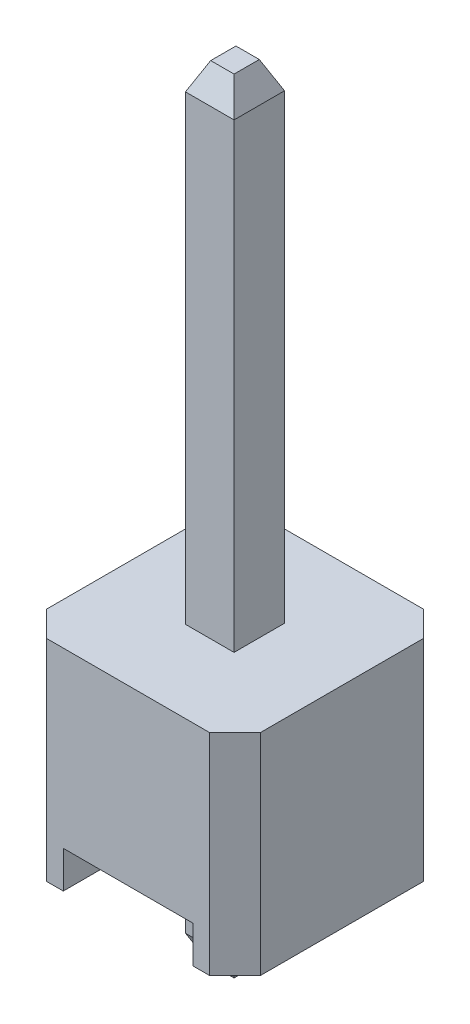
ISO-10303-21;
HEADER;
FILE_DESCRIPTION(('STEP AP214'),'2;1');
FILE_NAME('part.step','',(''),(''),'','','');
FILE_SCHEMA(('AUTOMOTIVE_DESIGN { 1 0 10303 214 1 1 1 1 }'));
ENDSEC;
DATA;
#1=APPLICATION_CONTEXT('core data for automotive mechanical design processes');
#2=APPLICATION_PROTOCOL_DEFINITION('international standard','automotive_design',2000,#1);
#3=PRODUCT_CONTEXT('',#1,'mechanical');
#4=PRODUCT('Part','Part','',(#3));
#5=PRODUCT_RELATED_PRODUCT_CATEGORY('part','',(#4));
#6=PRODUCT_DEFINITION_FORMATION('','',#4);
#7=PRODUCT_DEFINITION_CONTEXT('part definition',#1,'design');
#8=PRODUCT_DEFINITION('design','',#6,#7);
#9=PRODUCT_DEFINITION_SHAPE('','',#8);
#10=(LENGTH_UNIT() NAMED_UNIT(*) SI_UNIT(.MILLI.,.METRE.));
#11=(NAMED_UNIT(*) PLANE_ANGLE_UNIT() SI_UNIT($,.RADIAN.));
#12=(NAMED_UNIT(*) SI_UNIT($,.STERADIAN.) SOLID_ANGLE_UNIT());
#13=UNCERTAINTY_MEASURE_WITH_UNIT(LENGTH_MEASURE(1.E-05),#10,'distance_accuracy_value','');
#14=(GEOMETRIC_REPRESENTATION_CONTEXT(3) GLOBAL_UNCERTAINTY_ASSIGNED_CONTEXT((#13)) GLOBAL_UNIT_ASSIGNED_CONTEXT((#10,
#11,#12)) REPRESENTATION_CONTEXT('',''));
#15=CARTESIAN_POINT('',(0.,0.,0.));
#16=DIRECTION('',(0.,0.,1.));
#17=DIRECTION('',(1.,0.,0.));
#18=AXIS2_PLACEMENT_3D('',#15,#16,#17);
#19=CARTESIAN_POINT('',(-19.1812561045914,-5.69124998633488,-1.58837288882801));
#20=DIRECTION('',(0.,-1.,0.));
#21=DIRECTION('',(0.,0.,-1.));
#22=AXIS2_PLACEMENT_3D('',#19,#20,#21);
#23=PLANE('',#22);
#24=DIRECTION('',(0.,0.,1.));
#25=VECTOR('',#24,1.);
#26=CARTESIAN_POINT('',(-19.0312561045914,-5.69124998633488,-0.988372888828007));
#27=LINE('',#26,#25);
#28=CARTESIAN_POINT('',(-19.0312561045914,-5.69124998633488,-1.13837288882801));
#29=VERTEX_POINT('',#28);
#30=CARTESIAN_POINT('',(-19.0312561045914,-5.69124998633488,-1.43837288882801));
#31=VERTEX_POINT('',#30);
#32=EDGE_CURVE('E194',#29,#31,#27,.F.);
#33=ORIENTED_EDGE('',*,*,#32,.T.);
#34=DIRECTION('',(1.,0.,0.));
#35=VECTOR('',#34,1.);
#36=CARTESIAN_POINT('',(-19.1812561045914,-5.69124998633488,-1.43837288882801));
#37=LINE('',#36,#35);
#38=CARTESIAN_POINT('',(-18.7537499744834,-5.69124998633488,-1.43837288882801));
#39=VERTEX_POINT('',#38);
#40=EDGE_CURVE('E179',#31,#39,#37,.T.);
#41=ORIENTED_EDGE('',*,*,#40,.T.);
#42=DIRECTION('',(0.,0.,1.));
#43=VECTOR('',#42,1.);
#44=CARTESIAN_POINT('',(-18.7537499744834,-5.69124998633488,-1.58837288882801));
#45=LINE('',#44,#43);
#46=CARTESIAN_POINT('',(-18.7537499744834,-5.69124998633488,-1.13837288882801));
#47=VERTEX_POINT('',#46);
#48=EDGE_CURVE('E20',#39,#47,#45,.T.);
#49=ORIENTED_EDGE('',*,*,#48,.T.);
#50=DIRECTION('',(1.,0.,0.));
#51=VECTOR('',#50,1.);
#52=CARTESIAN_POINT('',(-18.6037499744834,-5.69124998633488,-1.13837288882801));
#53=LINE('',#52,#51);
#54=EDGE_CURVE('E174',#47,#29,#53,.F.);
#55=ORIENTED_EDGE('',*,*,#54,.T.);
#56=EDGE_LOOP('',(#33,#41,#49,#55));
#57=FACE_BOUND('',#56,.T.);
#58=ADVANCED_FACE('F17',(#57),#23,.T.);
#59=CARTESIAN_POINT('',(-18.6037499744834,-5.36957394825845,-1.58837288882801));
#60=DIRECTION('',(-0.90630778703665,0.4226182617407,0.));
#61=DIRECTION('',(-0.4226182617407,-0.90630778703665,0.));
#62=AXIS2_PLACEMENT_3D('',#59,#60,#61);
#63=PLANE('',#62);
#64=DIRECTION('',(0.,0.,-1.));
#65=VECTOR('',#64,1.);
#66=CARTESIAN_POINT('',(-18.6037499744834,-5.36957394825845,-1.58837288882801));
#67=LINE('',#66,#65);
#68=CARTESIAN_POINT('',(-18.6037499744834,-5.36957394825845,-0.988372888828007));
#69=VERTEX_POINT('',#68);
#70=CARTESIAN_POINT('',(-18.6037499744834,-5.36957394825845,-1.58837288882801));
#71=VERTEX_POINT('',#70);
#72=EDGE_CURVE('E186',#69,#71,#67,.T.);
#73=ORIENTED_EDGE('',*,*,#72,.F.);
#74=DIRECTION('',(-0.389281620635035,-0.834817129478983,-0.389281620635025));
#75=VECTOR('',#74,1.);
#76=CARTESIAN_POINT('',(-18.6037499744834,-5.36957394825845,-0.988372888828007));
#77=LINE('',#76,#75);
#78=EDGE_CURVE('E182',#69,#47,#77,.T.);
#79=ORIENTED_EDGE('',*,*,#78,.T.);
#80=ORIENTED_EDGE('',*,*,#48,.F.);
#81=DIRECTION('',(0.389281620635035,0.834817129478983,-0.389281620635025));
#82=VECTOR('',#81,1.);
#83=CARTESIAN_POINT('',(-18.7537499744834,-5.69124998633488,-1.43837288882801));
#84=LINE('',#83,#82);
#85=EDGE_CURVE('E202',#39,#71,#84,.T.);
#86=ORIENTED_EDGE('',*,*,#85,.T.);
#87=EDGE_LOOP('',(#73,#79,#80,#86));
#88=FACE_BOUND('',#87,.T.);
#89=ADVANCED_FACE('F184',(#88),#63,.F.);
#90=CARTESIAN_POINT('',(-18.6037499744834,-5.36957394825845,-0.988372888828007));
#91=DIRECTION('',(0.,0.422618261740701,-0.906307787036649));
#92=DIRECTION('',(0.,0.906307787036649,0.422618261740701));
#93=AXIS2_PLACEMENT_3D('',#90,#91,#92);
#94=PLANE('',#93);
#95=ORIENTED_EDGE('',*,*,#54,.F.);
#96=ORIENTED_EDGE('',*,*,#78,.F.);
#97=DIRECTION('',(1.,0.,0.));
#98=VECTOR('',#97,1.);
#99=CARTESIAN_POINT('',(-18.6037499744834,-5.36957394825845,-0.988372888828007));
#100=LINE('',#99,#98);
#101=CARTESIAN_POINT('',(-19.1812561045914,-5.36957394825845,-0.988372888828007));
#102=VERTEX_POINT('',#101);
#103=EDGE_CURVE('E205',#102,#69,#100,.T.);
#104=ORIENTED_EDGE('',*,*,#103,.F.);
#105=DIRECTION('',(0.389281620635027,-0.834817129478987,-0.389281620635025));
#106=VECTOR('',#105,1.);
#107=CARTESIAN_POINT('',(-19.1812561045914,-5.36957394825845,-0.988372888828007));
#108=LINE('',#107,#106);
#109=EDGE_CURVE('E191',#102,#29,#108,.T.);
#110=ORIENTED_EDGE('',*,*,#109,.T.);
#111=EDGE_LOOP('',(#95,#96,#104,#110));
#112=FACE_BOUND('',#111,.T.);
#113=ADVANCED_FACE('F189',(#112),#94,.F.);
#114=CARTESIAN_POINT('',(-19.1812561045914,-5.36957394825845,-0.988372888828007));
#115=DIRECTION('',(0.906307787036649,0.422618261740701,0.));
#116=DIRECTION('',(-0.422618261740701,0.906307787036649,0.));
#117=AXIS2_PLACEMENT_3D('',#114,#115,#116);
#118=PLANE('',#117);
#119=ORIENTED_EDGE('',*,*,#32,.F.);
#120=ORIENTED_EDGE('',*,*,#109,.F.);
#121=DIRECTION('',(0.,0.,1.));
#122=VECTOR('',#121,1.);
#123=CARTESIAN_POINT('',(-19.1812561045914,-5.36957394825845,-0.988372888828007));
#124=LINE('',#123,#122);
#125=CARTESIAN_POINT('',(-19.1812561045914,-5.36957394825845,-1.58837288882801));
#126=VERTEX_POINT('',#125);
#127=EDGE_CURVE('E211',#126,#102,#124,.T.);
#128=ORIENTED_EDGE('',*,*,#127,.F.);
#129=DIRECTION('',(0.389281620635027,-0.834817129478986,0.389281620635026));
#130=VECTOR('',#129,1.);
#131=CARTESIAN_POINT('',(-19.1812561045914,-5.36957394825845,-1.58837288882801));
#132=LINE('',#131,#130);
#133=EDGE_CURVE('E198',#126,#31,#132,.T.);
#134=ORIENTED_EDGE('',*,*,#133,.T.);
#135=EDGE_LOOP('',(#119,#120,#128,#134));
#136=FACE_BOUND('',#135,.T.);
#137=ADVANCED_FACE('F518',(#136),#118,.F.);
#138=CARTESIAN_POINT('',(-19.1812561045914,-5.36957394825845,-1.58837288882801));
#139=DIRECTION('',(0.,0.422618261740701,0.906307787036649));
#140=DIRECTION('',(0.,-0.906307787036649,0.422618261740701));
#141=AXIS2_PLACEMENT_3D('',#138,#139,#140);
#142=PLANE('',#141);
#143=ORIENTED_EDGE('',*,*,#40,.F.);
#144=ORIENTED_EDGE('',*,*,#133,.F.);
#145=DIRECTION('',(-1.,0.,0.));
#146=VECTOR('',#145,1.);
#147=CARTESIAN_POINT('',(-19.1812561045914,-5.36957394825845,-1.58837288882801));
#148=LINE('',#147,#146);
#149=EDGE_CURVE('E220',#71,#126,#148,.T.);
#150=ORIENTED_EDGE('',*,*,#149,.F.);
#151=ORIENTED_EDGE('',*,*,#85,.F.);
#152=EDGE_LOOP('',(#143,#144,#150,#151));
#153=FACE_BOUND('',#152,.T.);
#154=ADVANCED_FACE('F514',(#153),#142,.F.);
#155=CARTESIAN_POINT('',(-18.6037499744834,-5.69124998633488,-1.58837288882801));
#156=DIRECTION('',(1.,0.,0.));
#157=DIRECTION('',(0.,0.,-1.));
#158=AXIS2_PLACEMENT_3D('',#155,#156,#157);
#159=PLANE('',#158);
#160=DIRECTION('',(0.,1.,0.));
#161=VECTOR('',#160,1.);
#162=CARTESIAN_POINT('',(-18.6037499744834,-5.69124998633488,-1.58837288882801));
#163=LINE('',#162,#161);
#164=CARTESIAN_POINT('',(-18.6037499744834,-4.25124998633488,-1.58837288882801));
#165=VERTEX_POINT('',#164);
#166=EDGE_CURVE('E217',#165,#71,#163,.F.);
#167=ORIENTED_EDGE('',*,*,#166,.F.);
#168=DIRECTION('',(0.,0.,1.));
#169=VECTOR('',#168,1.);
#170=CARTESIAN_POINT('',(-18.6037499744834,-4.25124998633488,-0.018372888828007));
#171=LINE('',#170,#169);
#172=CARTESIAN_POINT('',(-18.6037499744834,-4.25124998633488,-0.988372888828007));
#173=VERTEX_POINT('',#172);
#174=EDGE_CURVE('E230',#165,#173,#171,.T.);
#175=ORIENTED_EDGE('',*,*,#174,.T.);
#176=DIRECTION('',(0.,1.,0.));
#177=VECTOR('',#176,1.);
#178=CARTESIAN_POINT('',(-18.6037499744834,-5.69124998633488,-0.988372888828007));
#179=LINE('',#178,#177);
#180=EDGE_CURVE('E208',#69,#173,#179,.T.);
#181=ORIENTED_EDGE('',*,*,#180,.F.);
#182=ORIENTED_EDGE('',*,*,#72,.T.);
#183=EDGE_LOOP('',(#167,#175,#181,#182));
#184=FACE_BOUND('',#183,.T.);
#185=ADVANCED_FACE('F510',(#184),#159,.T.);
#186=CARTESIAN_POINT('',(-18.6037499744834,-5.69124998633488,-0.988372888828007));
#187=DIRECTION('',(0.,0.,1.));
#188=DIRECTION('',(1.,0.,0.));
#189=AXIS2_PLACEMENT_3D('',#186,#187,#188);
#190=PLANE('',#189);
#191=ORIENTED_EDGE('',*,*,#180,.T.);
#192=DIRECTION('',(1.,0.,0.));
#193=VECTOR('',#192,1.);
#194=CARTESIAN_POINT('',(-18.1225030395374,-4.25124998633488,-0.988372888828007));
#195=LINE('',#194,#193);
#196=CARTESIAN_POINT('',(-19.1812561045914,-4.25124998633488,-0.988372888828007));
#197=VERTEX_POINT('',#196);
#198=EDGE_CURVE('E232',#173,#197,#195,.F.);
#199=ORIENTED_EDGE('',*,*,#198,.T.);
#200=DIRECTION('',(0.,1.,0.));
#201=VECTOR('',#200,1.);
#202=CARTESIAN_POINT('',(-19.1812561045914,-5.69124998633488,-0.988372888828007));
#203=LINE('',#202,#201);
#204=EDGE_CURVE('E214',#102,#197,#203,.T.);
#205=ORIENTED_EDGE('',*,*,#204,.F.);
#206=ORIENTED_EDGE('',*,*,#103,.T.);
#207=EDGE_LOOP('',(#191,#199,#205,#206));
#208=FACE_BOUND('',#207,.T.);
#209=ADVANCED_FACE('F506',(#208),#190,.T.);
#210=CARTESIAN_POINT('',(-19.1812561045914,-5.69124998633488,-0.988372888828007));
#211=DIRECTION('',(-1.,0.,0.));
#212=DIRECTION('',(0.,0.,1.));
#213=AXIS2_PLACEMENT_3D('',#210,#211,#212);
#214=PLANE('',#213);
#215=ORIENTED_EDGE('',*,*,#204,.T.);
#216=DIRECTION('',(0.,0.,1.));
#217=VECTOR('',#216,1.);
#218=CARTESIAN_POINT('',(-19.1812561045914,-4.25124998633488,-0.018372888828007));
#219=LINE('',#218,#217);
#220=CARTESIAN_POINT('',(-19.1812561045914,-4.25124998633488,-1.58837288882801));
#221=VERTEX_POINT('',#220);
#222=EDGE_CURVE('E234',#197,#221,#219,.F.);
#223=ORIENTED_EDGE('',*,*,#222,.T.);
#224=DIRECTION('',(0.,1.,0.));
#225=VECTOR('',#224,1.);
#226=CARTESIAN_POINT('',(-19.1812561045914,-5.69124998633488,-1.58837288882801));
#227=LINE('',#226,#225);
#228=EDGE_CURVE('E223',#126,#221,#227,.T.);
#229=ORIENTED_EDGE('',*,*,#228,.F.);
#230=ORIENTED_EDGE('',*,*,#127,.T.);
#231=EDGE_LOOP('',(#215,#223,#229,#230));
#232=FACE_BOUND('',#231,.T.);
#233=ADVANCED_FACE('F502',(#232),#214,.T.);
#234=CARTESIAN_POINT('',(-19.1812561045914,-5.69124998633488,-1.58837288882801));
#235=DIRECTION('',(0.,0.,-1.));
#236=DIRECTION('',(-1.,0.,0.));
#237=AXIS2_PLACEMENT_3D('',#234,#235,#236);
#238=PLANE('',#237);
#239=ORIENTED_EDGE('',*,*,#228,.T.);
#240=DIRECTION('',(1.,0.,0.));
#241=VECTOR('',#240,1.);
#242=CARTESIAN_POINT('',(-18.1225030395374,-4.25124998633488,-1.58837288882801));
#243=LINE('',#242,#241);
#244=EDGE_CURVE('E236',#221,#165,#243,.T.);
#245=ORIENTED_EDGE('',*,*,#244,.T.);
#246=ORIENTED_EDGE('',*,*,#166,.T.);
#247=ORIENTED_EDGE('',*,*,#149,.T.);
#248=EDGE_LOOP('',(#239,#245,#246,#247));
#249=FACE_BOUND('',#248,.T.);
#250=ADVANCED_FACE('F498',(#249),#238,.T.);
#251=CARTESIAN_POINT('',(-18.1225030395374,-4.25124998633488,-0.018372888828007));
#252=DIRECTION('',(0.,1.,0.));
#253=DIRECTION('',(0.,0.,1.));
#254=AXIS2_PLACEMENT_3D('',#251,#252,#253);
#255=PLANE('',#254);
#256=ORIENTED_EDGE('',*,*,#222,.F.);
#257=ORIENTED_EDGE('',*,*,#198,.F.);
#258=ORIENTED_EDGE('',*,*,#174,.F.);
#259=ORIENTED_EDGE('',*,*,#244,.F.);
#260=EDGE_LOOP('',(#256,#257,#258,#259));
#261=FACE_BOUND('',#260,.T.);
#262=DIRECTION('',(0.,0.,1.));
#263=VECTOR('',#262,1.);
#264=CARTESIAN_POINT('',(-19.6625030395374,-4.25124998633488,-0.018372888828007));
#265=LINE('',#264,#263);
#266=CARTESIAN_POINT('',(-19.6625030395374,-4.25124998633488,-0.018372888828007));
#267=VERTEX_POINT('',#266);
#268=CARTESIAN_POINT('',(-19.6625030395374,-4.25124998633488,-2.55837288882801));
#269=VERTEX_POINT('',#268);
#270=EDGE_CURVE('E241',#267,#269,#265,.F.);
#271=ORIENTED_EDGE('',*,*,#270,.T.);
#272=DIRECTION('',(1.,0.,0.));
#273=VECTOR('',#272,1.);
#274=CARTESIAN_POINT('',(-18.1225030395374,-4.25124998633488,-2.55837288882801));
#275=LINE('',#274,#273);
#276=CARTESIAN_POINT('',(-18.1225030395374,-4.25124998633488,-2.55837288882801));
#277=VERTEX_POINT('',#276);
#278=EDGE_CURVE('E226',#277,#269,#275,.F.);
#279=ORIENTED_EDGE('',*,*,#278,.F.);
#280=DIRECTION('',(0.,0.,-1.));
#281=VECTOR('',#280,1.);
#282=CARTESIAN_POINT('',(-18.1225030395374,-4.25124998633488,-0.018372888828007));
#283=LINE('',#282,#281);
#284=CARTESIAN_POINT('',(-18.1225030395374,-4.25124998633488,-0.018372888828007));
#285=VERTEX_POINT('',#284);
#286=EDGE_CURVE('E248',#277,#285,#283,.F.);
#287=ORIENTED_EDGE('',*,*,#286,.T.);
#288=DIRECTION('',(1.,0.,0.));
#289=VECTOR('',#288,1.);
#290=CARTESIAN_POINT('',(-18.1225030395374,-4.25124998633488,-0.018372888828007));
#291=LINE('',#290,#289);
#292=EDGE_CURVE('E228',#267,#285,#291,.T.);
#293=ORIENTED_EDGE('',*,*,#292,.F.);
#294=EDGE_LOOP('',(#271,#279,#287,#293));
#295=FACE_BOUND('',#294,.T.);
#296=ADVANCED_FACE('F495',(#261,#295),#255,.F.);
#297=CARTESIAN_POINT('',(-19.1812561045914,3.60875001366512,-1.43837288882801));
#298=DIRECTION('',(0.,0.422618261740697,-0.906307787036651));
#299=DIRECTION('',(0.,0.906307787036651,0.422618261740697));
#300=AXIS2_PLACEMENT_3D('',#297,#298,#299);
#301=PLANE('',#300);
#302=DIRECTION('',(-0.389281620635024,-0.834817129478989,-0.389281620635023));
#303=VECTOR('',#302,1.);
#304=CARTESIAN_POINT('',(-19.0312561045914,3.60875001366512,-1.43837288882801));
#305=LINE('',#304,#303);
#306=CARTESIAN_POINT('',(-19.0312561045914,3.60875001366512,-1.43837288882801));
#307=VERTEX_POINT('',#306);
#308=CARTESIAN_POINT('',(-19.1812561045914,3.28707397558869,-1.58837288882801));
#309=VERTEX_POINT('',#308);
#310=EDGE_CURVE('E263',#307,#309,#305,.T.);
#311=ORIENTED_EDGE('',*,*,#310,.F.);
#312=DIRECTION('',(1.,0.,0.));
#313=VECTOR('',#312,1.);
#314=CARTESIAN_POINT('',(-19.1812561045914,3.60875001366512,-1.43837288882801));
#315=LINE('',#314,#313);
#316=CARTESIAN_POINT('',(-18.7537499744834,3.60875001366512,-1.43837288882801));
#317=VERTEX_POINT('',#316);
#318=EDGE_CURVE('E256',#307,#317,#315,.T.);
#319=ORIENTED_EDGE('',*,*,#318,.T.);
#320=DIRECTION('',(-0.389281620635023,0.83481712947899,0.389281620635021));
#321=VECTOR('',#320,1.);
#322=CARTESIAN_POINT('',(-18.6037499744834,3.28707397558868,-1.58837288882801));
#323=LINE('',#322,#321);
#324=CARTESIAN_POINT('',(-18.6037499744834,3.28707397558869,-1.58837288882801));
#325=VERTEX_POINT('',#324);
#326=EDGE_CURVE('E253',#325,#317,#323,.T.);
#327=ORIENTED_EDGE('',*,*,#326,.F.);
#328=DIRECTION('',(-1.,0.,0.));
#329=VECTOR('',#328,1.);
#330=CARTESIAN_POINT('',(-19.1812561045914,3.28707397558869,-1.58837288882801));
#331=LINE('',#330,#329);
#332=EDGE_CURVE('E266',#309,#325,#331,.F.);
#333=ORIENTED_EDGE('',*,*,#332,.F.);
#334=EDGE_LOOP('',(#311,#319,#327,#333));
#335=FACE_BOUND('',#334,.T.);
#336=ADVANCED_FACE('F472',(#335),#301,.T.);
#337=CARTESIAN_POINT('',(-19.6625030395374,-4.25124998633488,-0.018372888828007));
#338=DIRECTION('',(-1.,0.,0.));
#339=DIRECTION('',(0.,0.,1.));
#340=AXIS2_PLACEMENT_3D('',#337,#338,#339);
#341=PLANE('',#340);
#342=DIRECTION('',(0.,1.,0.));
#343=VECTOR('',#342,1.);
#344=CARTESIAN_POINT('',(-19.6625030395374,-4.25124998633488,-2.55837288882801));
#345=LINE('',#344,#343);
#346=CARTESIAN_POINT('',(-19.6625030395374,-4.69124998633488,-2.55837288882801));
#347=VERTEX_POINT('',#346);
#348=EDGE_CURVE('E244',#269,#347,#345,.F.);
#349=ORIENTED_EDGE('',*,*,#348,.F.);
#350=ORIENTED_EDGE('',*,*,#270,.F.);
#351=DIRECTION('',(0.,1.,0.));
#352=VECTOR('',#351,1.);
#353=CARTESIAN_POINT('',(-19.6625030395374,-4.25124998633488,-0.018372888828007));
#354=LINE('',#353,#352);
#355=CARTESIAN_POINT('',(-19.6625030395374,-4.69124998633488,-0.018372888828007));
#356=VERTEX_POINT('',#355);
#357=EDGE_CURVE('E239',#356,#267,#354,.T.);
#358=ORIENTED_EDGE('',*,*,#357,.F.);
#359=DIRECTION('',(0.,0.,1.));
#360=VECTOR('',#359,1.);
#361=CARTESIAN_POINT('',(-19.6625030395374,-4.69124998633488,-1.28837288882801));
#362=LINE('',#361,#360);
#363=EDGE_CURVE('E273',#356,#347,#362,.F.);
#364=ORIENTED_EDGE('',*,*,#363,.T.);
#365=EDGE_LOOP('',(#349,#350,#358,#364));
#366=FACE_BOUND('',#365,.T.);
#367=ADVANCED_FACE('F488',(#366),#341,.F.);
#368=CARTESIAN_POINT('',(-18.1225030395374,-4.25124998633488,-0.018372888828007));
#369=DIRECTION('',(1.,0.,0.));
#370=DIRECTION('',(0.,0.,-1.));
#371=AXIS2_PLACEMENT_3D('',#368,#369,#370);
#372=PLANE('',#371);
#373=DIRECTION('',(0.,1.,0.));
#374=VECTOR('',#373,1.);
#375=CARTESIAN_POINT('',(-18.1225030395374,-4.25124998633488,-0.018372888828007));
#376=LINE('',#375,#374);
#377=CARTESIAN_POINT('',(-18.1225030395374,-4.69124998633488,-0.018372888828007));
#378=VERTEX_POINT('',#377);
#379=EDGE_CURVE('E251',#285,#378,#376,.F.);
#380=ORIENTED_EDGE('',*,*,#379,.F.);
#381=ORIENTED_EDGE('',*,*,#286,.F.);
#382=DIRECTION('',(0.,1.,0.));
#383=VECTOR('',#382,1.);
#384=CARTESIAN_POINT('',(-18.1225030395374,-4.25124998633488,-2.55837288882801));
#385=LINE('',#384,#383);
#386=CARTESIAN_POINT('',(-18.1225030395374,-4.69124998633488,-2.55837288882801));
#387=VERTEX_POINT('',#386);
#388=EDGE_CURVE('E246',#387,#277,#385,.T.);
#389=ORIENTED_EDGE('',*,*,#388,.F.);
#390=DIRECTION('',(0.,0.,1.));
#391=VECTOR('',#390,1.);
#392=CARTESIAN_POINT('',(-18.1225030395374,-4.69124998633488,-1.28837288882801));
#393=LINE('',#392,#391);
#394=EDGE_CURVE('E288',#387,#378,#393,.T.);
#395=ORIENTED_EDGE('',*,*,#394,.T.);
#396=EDGE_LOOP('',(#380,#381,#389,#395));
#397=FACE_BOUND('',#396,.T.);
#398=ADVANCED_FACE('F482',(#397),#372,.F.);
#399=CARTESIAN_POINT('',(-18.7537499744834,3.60875001366512,-1.58837288882801));
#400=DIRECTION('',(0.906307787036651,0.422618261740697,0.));
#401=DIRECTION('',(-0.422618261740697,0.906307787036651,0.));
#402=AXIS2_PLACEMENT_3D('',#399,#400,#401);
#403=PLANE('',#402);
#404=ORIENTED_EDGE('',*,*,#326,.T.);
#405=DIRECTION('',(0.,0.,-1.));
#406=VECTOR('',#405,1.);
#407=CARTESIAN_POINT('',(-18.7537499744834,3.60875001366512,-1.58837288882801));
#408=LINE('',#407,#406);
#409=CARTESIAN_POINT('',(-18.7537499744834,3.60875001366512,-1.13837288882801));
#410=VERTEX_POINT('',#409);
#411=EDGE_CURVE('E258',#317,#410,#408,.F.);
#412=ORIENTED_EDGE('',*,*,#411,.T.);
#413=DIRECTION('',(-0.389281620635032,0.834817129478986,-0.389281620635021));
#414=VECTOR('',#413,1.);
#415=CARTESIAN_POINT('',(-18.6037499744834,3.28707397558869,-0.988372888828007));
#416=LINE('',#415,#414);
#417=CARTESIAN_POINT('',(-18.6037499744834,3.28707397558869,-0.988372888828007));
#418=VERTEX_POINT('',#417);
#419=EDGE_CURVE('E310',#418,#410,#416,.T.);
#420=ORIENTED_EDGE('',*,*,#419,.F.);
#421=DIRECTION('',(0.,0.,-1.));
#422=VECTOR('',#421,1.);
#423=CARTESIAN_POINT('',(-18.6037499744834,3.28707397558869,-1.58837288882801));
#424=LINE('',#423,#422);
#425=EDGE_CURVE('E303',#325,#418,#424,.F.);
#426=ORIENTED_EDGE('',*,*,#425,.F.);
#427=EDGE_LOOP('',(#404,#412,#420,#426));
#428=FACE_BOUND('',#427,.T.);
#429=ADVANCED_FACE('F466',(#428),#403,.T.);
#430=CARTESIAN_POINT('',(-19.1812561045914,3.60875001366512,-1.58837288882801));
#431=DIRECTION('',(0.,-1.,0.));
#432=DIRECTION('',(0.,0.,-1.));
#433=AXIS2_PLACEMENT_3D('',#430,#431,#432);
#434=PLANE('',#433);
#435=ORIENTED_EDGE('',*,*,#318,.F.);
#436=DIRECTION('',(0.,0.,1.));
#437=VECTOR('',#436,1.);
#438=CARTESIAN_POINT('',(-19.0312561045914,3.60875001366512,-1.58837288882801));
#439=LINE('',#438,#437);
#440=CARTESIAN_POINT('',(-19.0312561045914,3.60875001366512,-1.13837288882801));
#441=VERTEX_POINT('',#440);
#442=EDGE_CURVE('E260',#441,#307,#439,.F.);
#443=ORIENTED_EDGE('',*,*,#442,.F.);
#444=DIRECTION('',(1.,0.,0.));
#445=VECTOR('',#444,1.);
#446=CARTESIAN_POINT('',(-19.1812561045914,3.60875001366512,-1.13837288882801));
#447=LINE('',#446,#445);
#448=EDGE_CURVE('E313',#410,#441,#447,.F.);
#449=ORIENTED_EDGE('',*,*,#448,.F.);
#450=ORIENTED_EDGE('',*,*,#411,.F.);
#451=EDGE_LOOP('',(#435,#443,#449,#450));
#452=FACE_BOUND('',#451,.T.);
#453=ADVANCED_FACE('F474',(#452),#434,.F.);
#454=CARTESIAN_POINT('',(-19.0312561045914,3.60875001366512,-1.58837288882801));
#455=DIRECTION('',(-0.906307787036651,0.422618261740697,0.));
#456=DIRECTION('',(-0.422618261740697,-0.906307787036651,0.));
#457=AXIS2_PLACEMENT_3D('',#454,#455,#456);
#458=PLANE('',#457);
#459=ORIENTED_EDGE('',*,*,#310,.T.);
#460=DIRECTION('',(0.,0.,1.));
#461=VECTOR('',#460,1.);
#462=CARTESIAN_POINT('',(-19.1812561045914,3.28707397558869,-0.988372888828007));
#463=LINE('',#462,#461);
#464=CARTESIAN_POINT('',(-19.1812561045914,3.28707397558869,-0.988372888828007));
#465=VERTEX_POINT('',#464);
#466=EDGE_CURVE('E316',#465,#309,#463,.F.);
#467=ORIENTED_EDGE('',*,*,#466,.F.);
#468=DIRECTION('',(-0.389281620635025,-0.834817129478989,0.389281620635023));
#469=VECTOR('',#468,1.);
#470=CARTESIAN_POINT('',(-19.0312561045914,3.60875001366512,-1.13837288882801));
#471=LINE('',#470,#469);
#472=EDGE_CURVE('E307',#441,#465,#471,.T.);
#473=ORIENTED_EDGE('',*,*,#472,.F.);
#474=ORIENTED_EDGE('',*,*,#442,.T.);
#475=EDGE_LOOP('',(#459,#467,#473,#474));
#476=FACE_BOUND('',#475,.T.);
#477=ADVANCED_FACE('F471',(#476),#458,.T.);
#478=CARTESIAN_POINT('',(-19.1812561045914,-5.69124998633488,-1.58837288882801));
#479=DIRECTION('',(0.,0.,-1.));
#480=DIRECTION('',(-1.,0.,0.));
#481=AXIS2_PLACEMENT_3D('',#478,#479,#480);
#482=PLANE('',#481);
#483=DIRECTION('',(0.,1.,0.));
#484=VECTOR('',#483,1.);
#485=CARTESIAN_POINT('',(-18.6037499744834,-5.69124998633488,-1.58837288882801));
#486=LINE('',#485,#484);
#487=CARTESIAN_POINT('',(-18.6037499744834,-2.19124998633488,-1.58837288882801));
#488=VERTEX_POINT('',#487);
#489=EDGE_CURVE('E300',#488,#325,#486,.T.);
#490=ORIENTED_EDGE('',*,*,#489,.F.);
#491=DIRECTION('',(-1.,0.,0.));
#492=VECTOR('',#491,1.);
#493=CARTESIAN_POINT('',(-19.1812561045914,-2.19124998633488,-1.58837288882801));
#494=LINE('',#493,#492);
#495=CARTESIAN_POINT('',(-19.1812561045914,-2.19124998633488,-1.58837288882801));
#496=VERTEX_POINT('',#495);
#497=EDGE_CURVE('E269',#488,#496,#494,.T.);
#498=ORIENTED_EDGE('',*,*,#497,.T.);
#499=DIRECTION('',(0.,1.,0.));
#500=VECTOR('',#499,1.);
#501=CARTESIAN_POINT('',(-19.1812561045914,-5.69124998633488,-1.58837288882801));
#502=LINE('',#501,#500);
#503=EDGE_CURVE('E319',#309,#496,#502,.F.);
#504=ORIENTED_EDGE('',*,*,#503,.F.);
#505=ORIENTED_EDGE('',*,*,#332,.T.);
#506=EDGE_LOOP('',(#490,#498,#504,#505));
#507=FACE_BOUND('',#506,.T.);
#508=ADVANCED_FACE('F462',(#507),#482,.T.);
#509=CARTESIAN_POINT('',(-21.1325030395374,-4.69124998633488,-1.28837288882801));
#510=DIRECTION('',(0.,1.,0.));
#511=DIRECTION('',(0.,0.,1.));
#512=AXIS2_PLACEMENT_3D('',#509,#510,#511);
#513=PLANE('',#512);
#514=ORIENTED_EDGE('',*,*,#363,.F.);
#515=DIRECTION('',(1.,0.,0.));
#516=VECTOR('',#515,1.);
#517=CARTESIAN_POINT('',(-21.1325030395374,-4.69124998633488,-0.0183728888280071));
#518=LINE('',#517,#516);
#519=CARTESIAN_POINT('',(-19.8625030395374,-4.69124998633488,-0.0183728888280068));
#520=VERTEX_POINT('',#519);
#521=EDGE_CURVE('E271',#520,#356,#518,.T.);
#522=ORIENTED_EDGE('',*,*,#521,.F.);
#523=DIRECTION('',(-0.707106781186549,0.,-0.707106781186546));
#524=VECTOR('',#523,1.);
#525=CARTESIAN_POINT('',(-20.1625030395374,-4.69124998633488,-0.318372888828006));
#526=LINE('',#525,#524);
#527=CARTESIAN_POINT('',(-20.1625030395374,-4.69124998633488,-0.318372888828006));
#528=VERTEX_POINT('',#527);
#529=EDGE_CURVE('E280',#520,#528,#526,.T.);
#530=ORIENTED_EDGE('',*,*,#529,.T.);
#531=DIRECTION('',(0.,0.,-1.));
#532=VECTOR('',#531,1.);
#533=CARTESIAN_POINT('',(-20.1625030395374,-4.69124998633488,-2.25837288882801));
#534=LINE('',#533,#532);
#535=CARTESIAN_POINT('',(-20.1625030395374,-4.69124998633488,-2.25837288882801));
#536=VERTEX_POINT('',#535);
#537=EDGE_CURVE('E330',#528,#536,#534,.T.);
#538=ORIENTED_EDGE('',*,*,#537,.T.);
#539=DIRECTION('',(0.707106781186549,0.,-0.707106781186546));
#540=VECTOR('',#539,1.);
#541=CARTESIAN_POINT('',(-19.8625030395374,-4.69124998633488,-2.55837288882801));
#542=LINE('',#541,#540);
#543=CARTESIAN_POINT('',(-19.8625030395374,-4.69124998633488,-2.55837288882801));
#544=VERTEX_POINT('',#543);
#545=EDGE_CURVE('E297',#536,#544,#542,.T.);
#546=ORIENTED_EDGE('',*,*,#545,.T.);
#547=DIRECTION('',(1.,0.,0.));
#548=VECTOR('',#547,1.);
#549=CARTESIAN_POINT('',(-21.1325030395374,-4.69124998633488,-2.55837288882801));
#550=LINE('',#549,#548);
#551=EDGE_CURVE('E276',#347,#544,#550,.F.);
#552=ORIENTED_EDGE('',*,*,#551,.F.);
#553=EDGE_LOOP('',(#514,#522,#530,#538,#546,#552));
#554=FACE_BOUND('',#553,.T.);
#555=ADVANCED_FACE('F630',(#554),#513,.F.);
#556=CARTESIAN_POINT('',(-20.1625030395374,-2.19124998633488,-0.318372888828006));
#557=DIRECTION('',(0.707106781186546,0.,-0.707106781186549));
#558=DIRECTION('',(-0.707106781186549,0.,-0.707106781186546));
#559=AXIS2_PLACEMENT_3D('',#556,#557,#558);
#560=PLANE('',#559);
#561=DIRECTION('',(0.,1.,0.));
#562=VECTOR('',#561,1.);
#563=CARTESIAN_POINT('',(-19.8625030395374,-2.19124998633488,-0.018372888828007));
#564=LINE('',#563,#562);
#565=CARTESIAN_POINT('',(-19.8625030395374,-2.19124998633488,-0.0183728888280065));
#566=VERTEX_POINT('',#565);
#567=EDGE_CURVE('E333',#520,#566,#564,.T.);
#568=ORIENTED_EDGE('',*,*,#567,.T.);
#569=DIRECTION('',(-0.707106781186549,0.,-0.707106781186546));
#570=VECTOR('',#569,1.);
#571=CARTESIAN_POINT('',(-20.1625030395374,-2.19124998633488,-0.318372888828006));
#572=LINE('',#571,#570);
#573=CARTESIAN_POINT('',(-20.1625030395374,-2.19124998633488,-0.318372888828006));
#574=VERTEX_POINT('',#573);
#575=EDGE_CURVE('E278',#574,#566,#572,.F.);
#576=ORIENTED_EDGE('',*,*,#575,.F.);
#577=DIRECTION('',(0.,1.,0.));
#578=VECTOR('',#577,1.);
#579=CARTESIAN_POINT('',(-20.1625030395374,-2.19124998633488,-0.318372888828006));
#580=LINE('',#579,#578);
#581=EDGE_CURVE('E327',#574,#528,#580,.F.);
#582=ORIENTED_EDGE('',*,*,#581,.T.);
#583=ORIENTED_EDGE('',*,*,#529,.F.);
#584=EDGE_LOOP('',(#568,#576,#582,#583));
#585=FACE_BOUND('',#584,.T.);
#586=ADVANCED_FACE('F395',(#585),#560,.F.);
#587=CARTESIAN_POINT('',(-17.9225030395374,-2.19124998633488,-0.018372888828007));
#588=DIRECTION('',(-0.707106781186549,0.,-0.707106781186546));
#589=DIRECTION('',(-0.707106781186546,0.,0.707106781186549));
#590=AXIS2_PLACEMENT_3D('',#587,#588,#589);
#591=PLANE('',#590);
#592=DIRECTION('',(0.,1.,0.));
#593=VECTOR('',#592,1.);
#594=CARTESIAN_POINT('',(-17.6225030395374,-2.19124998633488,-0.318372888828007));
#595=LINE('',#594,#593);
#596=CARTESIAN_POINT('',(-17.6225030395374,-4.69124998633488,-0.318372888828007));
#597=VERTEX_POINT('',#596);
#598=CARTESIAN_POINT('',(-17.6225030395374,-2.19124998633488,-0.318372888828007));
#599=VERTEX_POINT('',#598);
#600=EDGE_CURVE('E341',#597,#599,#595,.T.);
#601=ORIENTED_EDGE('',*,*,#600,.T.);
#602=DIRECTION('',(-0.707106781186546,0.,0.707106781186549));
#603=VECTOR('',#602,1.);
#604=CARTESIAN_POINT('',(-17.9225030395374,-2.19124998633488,-0.018372888828007));
#605=LINE('',#604,#603);
#606=CARTESIAN_POINT('',(-17.9225030395374,-2.19124998633488,-0.018372888828007));
#607=VERTEX_POINT('',#606);
#608=EDGE_CURVE('E282',#607,#599,#605,.F.);
#609=ORIENTED_EDGE('',*,*,#608,.F.);
#610=DIRECTION('',(0.,1.,0.));
#611=VECTOR('',#610,1.);
#612=CARTESIAN_POINT('',(-17.9225030395374,-2.19124998633488,-0.018372888828007));
#613=LINE('',#612,#611);
#614=CARTESIAN_POINT('',(-17.9225030395374,-4.69124998633488,-0.018372888828007));
#615=VERTEX_POINT('',#614);
#616=EDGE_CURVE('E336',#607,#615,#613,.F.);
#617=ORIENTED_EDGE('',*,*,#616,.T.);
#618=DIRECTION('',(0.707106781186545,0.,-0.70710678118655));
#619=VECTOR('',#618,1.);
#620=CARTESIAN_POINT('',(-17.9225030395374,-4.69124998633488,-0.0183728888280071));
#621=LINE('',#620,#619);
#622=EDGE_CURVE('E284',#615,#597,#621,.T.);
#623=ORIENTED_EDGE('',*,*,#622,.T.);
#624=EDGE_LOOP('',(#601,#609,#617,#623));
#625=FACE_BOUND('',#624,.T.);
#626=ADVANCED_FACE('F402',(#625),#591,.F.);
#627=CARTESIAN_POINT('',(-21.1325030395374,-4.69124998633488,-1.28837288882801));
#628=DIRECTION('',(0.,1.,0.));
#629=DIRECTION('',(0.,0.,1.));
#630=AXIS2_PLACEMENT_3D('',#627,#628,#629);
#631=PLANE('',#630);
#632=ORIENTED_EDGE('',*,*,#394,.F.);
#633=DIRECTION('',(1.,0.,0.));
#634=VECTOR('',#633,1.);
#635=CARTESIAN_POINT('',(-21.1325030395374,-4.69124998633488,-2.55837288882801));
#636=LINE('',#635,#634);
#637=CARTESIAN_POINT('',(-17.9225030395374,-4.69124998633488,-2.55837288882801));
#638=VERTEX_POINT('',#637);
#639=EDGE_CURVE('E286',#638,#387,#636,.F.);
#640=ORIENTED_EDGE('',*,*,#639,.F.);
#641=DIRECTION('',(0.707106781186547,0.,0.707106781186548));
#642=VECTOR('',#641,1.);
#643=CARTESIAN_POINT('',(-17.6225030395374,-4.69124998633488,-2.25837288882801));
#644=LINE('',#643,#642);
#645=CARTESIAN_POINT('',(-17.6225030395374,-4.69124998633488,-2.25837288882801));
#646=VERTEX_POINT('',#645);
#647=EDGE_CURVE('E293',#638,#646,#644,.T.);
#648=ORIENTED_EDGE('',*,*,#647,.T.);
#649=DIRECTION('',(0.,0.,1.));
#650=VECTOR('',#649,1.);
#651=CARTESIAN_POINT('',(-17.6225030395374,-4.69124998633488,-0.318372888828007));
#652=LINE('',#651,#650);
#653=EDGE_CURVE('E347',#646,#597,#652,.T.);
#654=ORIENTED_EDGE('',*,*,#653,.T.);
#655=ORIENTED_EDGE('',*,*,#622,.F.);
#656=DIRECTION('',(-1.,0.,0.));
#657=VECTOR('',#656,1.);
#658=CARTESIAN_POINT('',(-19.8625030395374,-4.69124998633488,-0.018372888828007));
#659=LINE('',#658,#657);
#660=EDGE_CURVE('E338',#615,#378,#659,.T.);
#661=ORIENTED_EDGE('',*,*,#660,.T.);
#662=EDGE_LOOP('',(#632,#640,#648,#654,#655,#661));
#663=FACE_BOUND('',#662,.T.);
#664=ADVANCED_FACE('F405',(#663),#631,.F.);
#665=CARTESIAN_POINT('',(-17.6225030395374,-2.19124998633488,-2.25837288882801));
#666=DIRECTION('',(-0.707106781186548,0.,0.707106781186547));
#667=DIRECTION('',(0.707106781186547,0.,0.707106781186548));
#668=AXIS2_PLACEMENT_3D('',#665,#666,#667);
#669=PLANE('',#668);
#670=DIRECTION('',(0.,1.,0.));
#671=VECTOR('',#670,1.);
#672=CARTESIAN_POINT('',(-17.9225030395374,-2.19124998633488,-2.55837288882801));
#673=LINE('',#672,#671);
#674=CARTESIAN_POINT('',(-17.9225030395374,-2.19124998633488,-2.55837288882801));
#675=VERTEX_POINT('',#674);
#676=EDGE_CURVE('E350',#638,#675,#673,.T.);
#677=ORIENTED_EDGE('',*,*,#676,.T.);
#678=DIRECTION('',(0.707106781186547,0.,0.707106781186548));
#679=VECTOR('',#678,1.);
#680=CARTESIAN_POINT('',(-17.6225030395374,-2.19124998633488,-2.25837288882801));
#681=LINE('',#680,#679);
#682=CARTESIAN_POINT('',(-17.6225030395374,-2.19124998633488,-2.25837288882801));
#683=VERTEX_POINT('',#682);
#684=EDGE_CURVE('E291',#683,#675,#681,.F.);
#685=ORIENTED_EDGE('',*,*,#684,.F.);
#686=DIRECTION('',(0.,1.,0.));
#687=VECTOR('',#686,1.);
#688=CARTESIAN_POINT('',(-17.6225030395374,-2.19124998633488,-2.25837288882801));
#689=LINE('',#688,#687);
#690=EDGE_CURVE('E344',#683,#646,#689,.F.);
#691=ORIENTED_EDGE('',*,*,#690,.T.);
#692=ORIENTED_EDGE('',*,*,#647,.F.);
#693=EDGE_LOOP('',(#677,#685,#691,#692));
#694=FACE_BOUND('',#693,.T.);
#695=ADVANCED_FACE('F414',(#694),#669,.F.);
#696=CARTESIAN_POINT('',(-19.8625030395374,-2.19124998633488,-2.55837288882801));
#697=DIRECTION('',(0.707106781186546,0.,0.707106781186549));
#698=DIRECTION('',(0.707106781186549,0.,-0.707106781186546));
#699=AXIS2_PLACEMENT_3D('',#696,#697,#698);
#700=PLANE('',#699);
#701=DIRECTION('',(0.,1.,0.));
#702=VECTOR('',#701,1.);
#703=CARTESIAN_POINT('',(-20.1625030395374,-2.19124998633488,-2.25837288882801));
#704=LINE('',#703,#702);
#705=CARTESIAN_POINT('',(-20.1625030395374,-2.19124998633488,-2.25837288882801));
#706=VERTEX_POINT('',#705);
#707=EDGE_CURVE('E324',#536,#706,#704,.T.);
#708=ORIENTED_EDGE('',*,*,#707,.T.);
#709=DIRECTION('',(0.707106781186549,0.,-0.707106781186546));
#710=VECTOR('',#709,1.);
#711=CARTESIAN_POINT('',(-19.8625030395374,-2.19124998633488,-2.55837288882801));
#712=LINE('',#711,#710);
#713=CARTESIAN_POINT('',(-19.8625030395374,-2.19124998633488,-2.55837288882801));
#714=VERTEX_POINT('',#713);
#715=EDGE_CURVE('E295',#714,#706,#712,.F.);
#716=ORIENTED_EDGE('',*,*,#715,.F.);
#717=DIRECTION('',(0.,1.,0.));
#718=VECTOR('',#717,1.);
#719=CARTESIAN_POINT('',(-19.8625030395374,-2.19124998633488,-2.55837288882801));
#720=LINE('',#719,#718);
#721=EDGE_CURVE('E353',#714,#544,#720,.F.);
#722=ORIENTED_EDGE('',*,*,#721,.T.);
#723=ORIENTED_EDGE('',*,*,#545,.F.);
#724=EDGE_LOOP('',(#708,#716,#722,#723));
#725=FACE_BOUND('',#724,.T.);
#726=ADVANCED_FACE('F384',(#725),#700,.F.);
#727=CARTESIAN_POINT('',(-18.6037499744834,-5.69124998633488,-1.58837288882801));
#728=DIRECTION('',(1.,0.,0.));
#729=DIRECTION('',(0.,0.,-1.));
#730=AXIS2_PLACEMENT_3D('',#727,#728,#729);
#731=PLANE('',#730);
#732=DIRECTION('',(0.,1.,0.));
#733=VECTOR('',#732,1.);
#734=CARTESIAN_POINT('',(-18.6037499744834,-5.69124998633488,-0.988372888828007));
#735=LINE('',#734,#733);
#736=CARTESIAN_POINT('',(-18.6037499744834,-2.19124998633488,-0.988372888828007));
#737=VERTEX_POINT('',#736);
#738=EDGE_CURVE('E356',#737,#418,#735,.T.);
#739=ORIENTED_EDGE('',*,*,#738,.F.);
#740=DIRECTION('',(0.,0.,-1.));
#741=VECTOR('',#740,1.);
#742=CARTESIAN_POINT('',(-18.6037499744834,-2.19124998633488,-1.58837288882801));
#743=LINE('',#742,#741);
#744=EDGE_CURVE('E34',#737,#488,#743,.T.);
#745=ORIENTED_EDGE('',*,*,#744,.T.);
#746=ORIENTED_EDGE('',*,*,#489,.T.);
#747=ORIENTED_EDGE('',*,*,#425,.T.);
#748=EDGE_LOOP('',(#739,#745,#746,#747));
#749=FACE_BOUND('',#748,.T.);
#750=ADVANCED_FACE('F422',(#749),#731,.T.);
#751=CARTESIAN_POINT('',(-19.1812561045914,3.60875001366512,-1.13837288882801));
#752=DIRECTION('',(0.,0.422618261740697,0.906307787036651));
#753=DIRECTION('',(0.,-0.906307787036651,0.422618261740697));
#754=AXIS2_PLACEMENT_3D('',#751,#752,#753);
#755=PLANE('',#754);
#756=ORIENTED_EDGE('',*,*,#419,.T.);
#757=ORIENTED_EDGE('',*,*,#448,.T.);
#758=ORIENTED_EDGE('',*,*,#472,.T.);
#759=DIRECTION('',(1.,0.,0.));
#760=VECTOR('',#759,1.);
#761=CARTESIAN_POINT('',(-18.6037499744834,3.28707397558869,-0.988372888828007));
#762=LINE('',#761,#760);
#763=EDGE_CURVE('E359',#418,#465,#762,.F.);
#764=ORIENTED_EDGE('',*,*,#763,.F.);
#765=EDGE_LOOP('',(#756,#757,#758,#764));
#766=FACE_BOUND('',#765,.T.);
#767=ADVANCED_FACE('F445',(#766),#755,.T.);
#768=CARTESIAN_POINT('',(-19.1812561045914,-5.69124998633488,-0.988372888828007));
#769=DIRECTION('',(-1.,0.,0.));
#770=DIRECTION('',(0.,0.,1.));
#771=AXIS2_PLACEMENT_3D('',#768,#769,#770);
#772=PLANE('',#771);
#773=ORIENTED_EDGE('',*,*,#503,.T.);
#774=DIRECTION('',(0.,0.,1.));
#775=VECTOR('',#774,1.);
#776=CARTESIAN_POINT('',(-19.1812561045914,-2.19124998633488,-0.988372888828007));
#777=LINE('',#776,#775);
#778=CARTESIAN_POINT('',(-19.1812561045914,-2.19124998633488,-0.988372888828007));
#779=VERTEX_POINT('',#778);
#780=EDGE_CURVE('E322',#496,#779,#777,.T.);
#781=ORIENTED_EDGE('',*,*,#780,.T.);
#782=DIRECTION('',(0.,1.,0.));
#783=VECTOR('',#782,1.);
#784=CARTESIAN_POINT('',(-19.1812561045914,-5.69124998633488,-0.988372888828007));
#785=LINE('',#784,#783);
#786=EDGE_CURVE('E362',#465,#779,#785,.F.);
#787=ORIENTED_EDGE('',*,*,#786,.F.);
#788=ORIENTED_EDGE('',*,*,#466,.T.);
#789=EDGE_LOOP('',(#773,#781,#787,#788));
#790=FACE_BOUND('',#789,.T.);
#791=ADVANCED_FACE('F442',(#790),#772,.T.);
#792=CARTESIAN_POINT('',(-20.1625030395374,-2.19124998633488,-2.25837288882801));
#793=DIRECTION('',(1.,0.,0.));
#794=DIRECTION('',(0.,0.,-1.));
#795=AXIS2_PLACEMENT_3D('',#792,#793,#794);
#796=PLANE('',#795);
#797=ORIENTED_EDGE('',*,*,#581,.F.);
#798=DIRECTION('',(0.,0.,1.));
#799=VECTOR('',#798,1.);
#800=CARTESIAN_POINT('',(-20.1625030395374,-2.19124998633488,-1.28837288882801));
#801=LINE('',#800,#799);
#802=EDGE_CURVE('E365',#706,#574,#801,.T.);
#803=ORIENTED_EDGE('',*,*,#802,.F.);
#804=ORIENTED_EDGE('',*,*,#707,.F.);
#805=ORIENTED_EDGE('',*,*,#537,.F.);
#806=EDGE_LOOP('',(#797,#803,#804,#805));
#807=FACE_BOUND('',#806,.T.);
#808=ADVANCED_FACE('F390',(#807),#796,.F.);
#809=CARTESIAN_POINT('',(-19.8625030395374,-2.19124998633488,-0.018372888828007));
#810=DIRECTION('',(0.,0.,-1.));
#811=DIRECTION('',(-1.,0.,0.));
#812=AXIS2_PLACEMENT_3D('',#809,#810,#811);
#813=PLANE('',#812);
#814=ORIENTED_EDGE('',*,*,#379,.T.);
#815=ORIENTED_EDGE('',*,*,#660,.F.);
#816=ORIENTED_EDGE('',*,*,#616,.F.);
#817=DIRECTION('',(1.,0.,0.));
#818=VECTOR('',#817,1.);
#819=CARTESIAN_POINT('',(-21.1325030395374,-2.19124998633488,-0.0183728888280071));
#820=LINE('',#819,#818);
#821=EDGE_CURVE('E368',#566,#607,#820,.T.);
#822=ORIENTED_EDGE('',*,*,#821,.F.);
#823=ORIENTED_EDGE('',*,*,#567,.F.);
#824=ORIENTED_EDGE('',*,*,#521,.T.);
#825=ORIENTED_EDGE('',*,*,#357,.T.);
#826=ORIENTED_EDGE('',*,*,#292,.T.);
#827=EDGE_LOOP('',(#814,#815,#816,#822,#823,#824,#825,#826));
#828=FACE_BOUND('',#827,.T.);
#829=ADVANCED_FACE('F398',(#828),#813,.F.);
#830=CARTESIAN_POINT('',(-17.6225030395374,-2.19124998633488,-0.318372888828007));
#831=DIRECTION('',(-1.,0.,0.));
#832=DIRECTION('',(0.,0.,1.));
#833=AXIS2_PLACEMENT_3D('',#830,#831,#832);
#834=PLANE('',#833);
#835=ORIENTED_EDGE('',*,*,#690,.F.);
#836=DIRECTION('',(0.,0.,1.));
#837=VECTOR('',#836,1.);
#838=CARTESIAN_POINT('',(-17.6225030395374,-2.19124998633488,-1.28837288882801));
#839=LINE('',#838,#837);
#840=EDGE_CURVE('E371',#599,#683,#839,.F.);
#841=ORIENTED_EDGE('',*,*,#840,.F.);
#842=ORIENTED_EDGE('',*,*,#600,.F.);
#843=ORIENTED_EDGE('',*,*,#653,.F.);
#844=EDGE_LOOP('',(#835,#841,#842,#843));
#845=FACE_BOUND('',#844,.T.);
#846=ADVANCED_FACE('F412',(#845),#834,.F.);
#847=CARTESIAN_POINT('',(-17.9225030395374,-2.19124998633488,-2.55837288882801));
#848=DIRECTION('',(0.,0.,1.));
#849=DIRECTION('',(1.,0.,0.));
#850=AXIS2_PLACEMENT_3D('',#847,#848,#849);
#851=PLANE('',#850);
#852=ORIENTED_EDGE('',*,*,#388,.T.);
#853=ORIENTED_EDGE('',*,*,#278,.T.);
#854=ORIENTED_EDGE('',*,*,#348,.T.);
#855=ORIENTED_EDGE('',*,*,#551,.T.);
#856=ORIENTED_EDGE('',*,*,#721,.F.);
#857=DIRECTION('',(1.,0.,0.));
#858=VECTOR('',#857,1.);
#859=CARTESIAN_POINT('',(-21.1325030395374,-2.19124998633488,-2.55837288882801));
#860=LINE('',#859,#858);
#861=EDGE_CURVE('E26',#675,#714,#860,.F.);
#862=ORIENTED_EDGE('',*,*,#861,.F.);
#863=ORIENTED_EDGE('',*,*,#676,.F.);
#864=ORIENTED_EDGE('',*,*,#639,.T.);
#865=EDGE_LOOP('',(#852,#853,#854,#855,#856,#862,#863,#864));
#866=FACE_BOUND('',#865,.T.);
#867=ADVANCED_FACE('F381',(#866),#851,.F.);
#868=CARTESIAN_POINT('',(-18.6037499744834,-5.69124998633488,-0.988372888828007));
#869=DIRECTION('',(0.,0.,1.));
#870=DIRECTION('',(1.,0.,0.));
#871=AXIS2_PLACEMENT_3D('',#868,#869,#870);
#872=PLANE('',#871);
#873=ORIENTED_EDGE('',*,*,#786,.T.);
#874=DIRECTION('',(1.,0.,0.));
#875=VECTOR('',#874,1.);
#876=CARTESIAN_POINT('',(-21.1325030395374,-2.19124998633488,-0.988372888828007));
#877=LINE('',#876,#875);
#878=EDGE_CURVE('E11',#737,#779,#877,.F.);
#879=ORIENTED_EDGE('',*,*,#878,.F.);
#880=ORIENTED_EDGE('',*,*,#738,.T.);
#881=ORIENTED_EDGE('',*,*,#763,.T.);
#882=EDGE_LOOP('',(#873,#879,#880,#881));
#883=FACE_BOUND('',#882,.T.);
#884=ADVANCED_FACE('F426',(#883),#872,.T.);
#885=CARTESIAN_POINT('',(-21.1325030395374,-2.19124998633488,-1.28837288882801));
#886=DIRECTION('',(0.,1.,0.));
#887=DIRECTION('',(0.,0.,1.));
#888=AXIS2_PLACEMENT_3D('',#885,#886,#887);
#889=PLANE('',#888);
#890=ORIENTED_EDGE('',*,*,#744,.F.);
#891=ORIENTED_EDGE('',*,*,#878,.T.);
#892=ORIENTED_EDGE('',*,*,#780,.F.);
#893=ORIENTED_EDGE('',*,*,#497,.F.);
#894=EDGE_LOOP('',(#890,#891,#892,#893));
#895=FACE_BOUND('',#894,.T.);
#896=ORIENTED_EDGE('',*,*,#684,.T.);
#897=ORIENTED_EDGE('',*,*,#861,.T.);
#898=ORIENTED_EDGE('',*,*,#715,.T.);
#899=ORIENTED_EDGE('',*,*,#802,.T.);
#900=ORIENTED_EDGE('',*,*,#575,.T.);
#901=ORIENTED_EDGE('',*,*,#821,.T.);
#902=ORIENTED_EDGE('',*,*,#608,.T.);
#903=ORIENTED_EDGE('',*,*,#840,.T.);
#904=EDGE_LOOP('',(#896,#897,#898,#899,#900,#901,#902,#903));
#905=FACE_BOUND('',#904,.T.);
#906=ADVANCED_FACE('F377',(#895,#905),#889,.T.);
#907=CLOSED_SHELL('',(#58,#89,#113,#137,#154,#185,#209,#233,#250,#296,#336,#367,#398,#429,#453,
#477,#508,#555,#586,#626,#664,#695,#726,#750,#767,#791,#808,#829,#846,#867,#884,#906));
#908=MANIFOLD_SOLID_BREP('B1',#907);
#909=ADVANCED_BREP_SHAPE_REPRESENTATION('',(#18,#908),#14);
#910=SHAPE_DEFINITION_REPRESENTATION(#9,#909);
ENDSEC;
END-ISO-10303-21;
